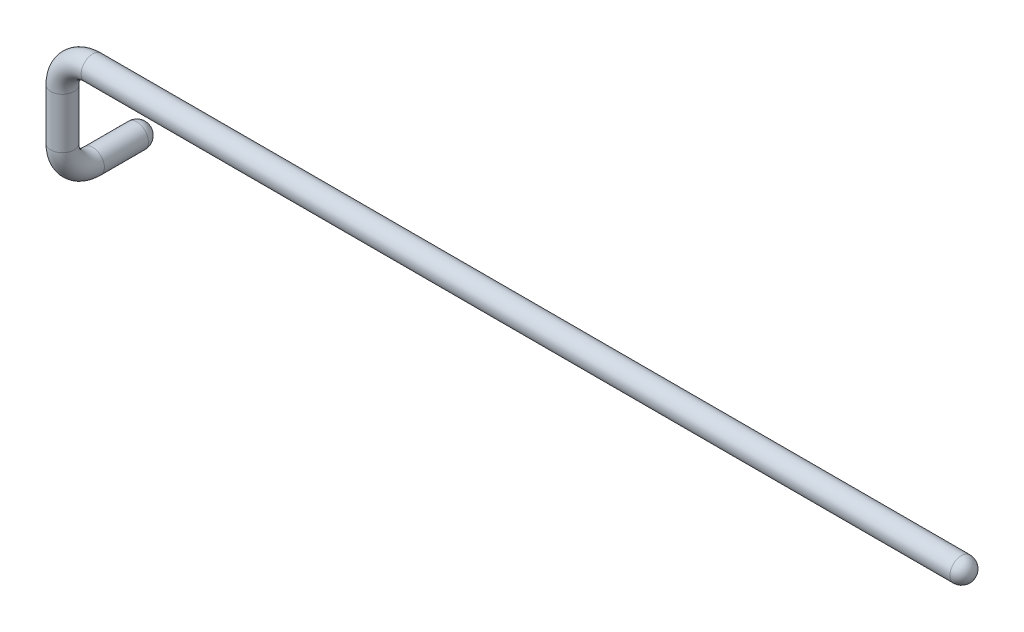
ISO-10303-21;
HEADER;
FILE_DESCRIPTION(('STEP AP214'),'2;1');
FILE_NAME('part.step','',(''),(''),'','','');
FILE_SCHEMA(('AUTOMOTIVE_DESIGN { 1 0 10303 214 1 1 1 1 }'));
ENDSEC;
DATA;
#1=APPLICATION_CONTEXT('core data for automotive mechanical design processes');
#2=APPLICATION_PROTOCOL_DEFINITION('international standard','automotive_design',2000,#1);
#3=PRODUCT_CONTEXT('',#1,'mechanical');
#4=PRODUCT('Part','Part','',(#3));
#5=PRODUCT_RELATED_PRODUCT_CATEGORY('part','',(#4));
#6=PRODUCT_DEFINITION_FORMATION('','',#4);
#7=PRODUCT_DEFINITION_CONTEXT('part definition',#1,'design');
#8=PRODUCT_DEFINITION('design','',#6,#7);
#9=PRODUCT_DEFINITION_SHAPE('','',#8);
#10=(LENGTH_UNIT() NAMED_UNIT(*) SI_UNIT(.MILLI.,.METRE.));
#11=(NAMED_UNIT(*) PLANE_ANGLE_UNIT() SI_UNIT($,.RADIAN.));
#12=(NAMED_UNIT(*) SI_UNIT($,.STERADIAN.) SOLID_ANGLE_UNIT());
#13=UNCERTAINTY_MEASURE_WITH_UNIT(LENGTH_MEASURE(1.E-05),#10,'distance_accuracy_value','');
#14=(GEOMETRIC_REPRESENTATION_CONTEXT(3) GLOBAL_UNCERTAINTY_ASSIGNED_CONTEXT((#13)) GLOBAL_UNIT_ASSIGNED_CONTEXT((#10,
#11,#12)) REPRESENTATION_CONTEXT('',''));
#15=CARTESIAN_POINT('',(0.,0.,0.));
#16=DIRECTION('',(0.,0.,1.));
#17=DIRECTION('',(1.,0.,0.));
#18=AXIS2_PLACEMENT_3D('',#15,#16,#17);
#19=CARTESIAN_POINT('',(0.,0.,0.));
#20=DIRECTION('',(0.,1.,0.));
#21=DIRECTION('',(0.,0.,1.));
#22=AXIS2_PLACEMENT_3D('',#19,#20,#21);
#23=CYLINDRICAL_SURFACE('',#22,0.575);
#24=CARTESIAN_POINT('',(0.,2.25,0.));
#25=DIRECTION('',(0.,1.,0.));
#26=DIRECTION('',(0.,0.,-1.));
#27=AXIS2_PLACEMENT_3D('',#24,#25,#26);
#28=CIRCLE('',#27,0.575);
#29=CARTESIAN_POINT('',(-0.575,2.25,0.));
#30=VERTEX_POINT('',#29);
#31=EDGE_CURVE('E51',#30,#30,#28,.T.);
#32=ORIENTED_EDGE('',*,*,#31,.F.);
#33=EDGE_LOOP('',(#32));
#34=FACE_BOUND('',#33,.T.);
#35=CARTESIAN_POINT('',(0.,-0.249999999999989,0.));
#36=DIRECTION('',(0.,1.,0.));
#37=DIRECTION('',(0.,0.,1.));
#38=AXIS2_PLACEMENT_3D('',#35,#36,#37);
#39=CIRCLE('',#38,0.575);
#40=CARTESIAN_POINT('',(0.,-0.249999999999985,0.575));
#41=VERTEX_POINT('',#40);
#42=EDGE_CURVE('E59',#41,#41,#39,.T.);
#43=ORIENTED_EDGE('',*,*,#42,.T.);
#44=EDGE_LOOP('',(#43));
#45=FACE_BOUND('',#44,.T.);
#46=ADVANCED_FACE('F36',(#34,#45),#23,.T.);
#47=CARTESIAN_POINT('',(1.5,2.25,0.));
#48=DIRECTION('',(0.,0.,-1.));
#49=DIRECTION('',(-1.,0.,0.));
#50=AXIS2_PLACEMENT_3D('',#47,#48,#49);
#51=TOROIDAL_SURFACE('',#50,1.5,0.575);
#52=CARTESIAN_POINT('',(1.5,3.75,0.));
#53=DIRECTION('',(1.,0.,0.));
#54=DIRECTION('',(0.,0.,-1.));
#55=AXIS2_PLACEMENT_3D('',#52,#53,#54);
#56=CIRCLE('',#55,0.575);
#57=CARTESIAN_POINT('',(1.5,4.325,0.));
#58=VERTEX_POINT('',#57);
#59=EDGE_CURVE('E47',#58,#58,#56,.T.);
#60=CARTESIAN_POINT('',(1.5,2.25,0.));
#61=DIRECTION('',(0.,0.,-1.));
#62=DIRECTION('',(-1.,0.,0.));
#63=AXIS2_PLACEMENT_3D('',#60,#61,#62);
#64=CIRCLE('',#63,2.075);
#65=EDGE_CURVE('',#30,#58,#64,.T.);
#66=ORIENTED_EDGE('',*,*,#31,.T.);
#67=ORIENTED_EDGE('',*,*,#59,.F.);
#68=ORIENTED_EDGE('',*,*,#65,.T.);
#69=ORIENTED_EDGE('',*,*,#65,.F.);
#70=EDGE_LOOP('',(#66,#68,#67,#69));
#71=FACE_BOUND('',#70,.T.);
#72=ADVANCED_FACE('F76',(#71),#51,.T.);
#73=CARTESIAN_POINT('',(1.5,3.75,0.));
#74=DIRECTION('',(1.,0.,0.));
#75=DIRECTION('',(0.,0.,-1.));
#76=AXIS2_PLACEMENT_3D('',#73,#74,#75);
#77=CYLINDRICAL_SURFACE('',#76,0.575);
#78=CARTESIAN_POINT('',(44.425,3.75,0.));
#79=DIRECTION('',(1.,0.,0.));
#80=DIRECTION('',(0.,0.,-1.));
#81=AXIS2_PLACEMENT_3D('',#78,#79,#80);
#82=CIRCLE('',#81,0.575);
#83=CARTESIAN_POINT('',(44.425,3.75,-0.575));
#84=VERTEX_POINT('',#83);
#85=EDGE_CURVE('E11',#84,#84,#82,.F.);
#86=ORIENTED_EDGE('',*,*,#85,.T.);
#87=EDGE_LOOP('',(#86));
#88=FACE_BOUND('',#87,.T.);
#89=ORIENTED_EDGE('',*,*,#59,.T.);
#90=EDGE_LOOP('',(#89));
#91=FACE_BOUND('',#90,.T.);
#92=ADVANCED_FACE('F67',(#88,#91),#77,.T.);
#93=CARTESIAN_POINT('',(0.,-0.25,-1.5));
#94=DIRECTION('',(1.,0.,0.));
#95=DIRECTION('',(0.,0.,-1.));
#96=AXIS2_PLACEMENT_3D('',#93,#94,#95);
#97=TOROIDAL_SURFACE('',#96,1.5,0.575);
#98=CARTESIAN_POINT('',(0.,-1.75,-1.50000000000001));
#99=DIRECTION('',(0.,0.,1.));
#100=DIRECTION('',(0.,-1.,0.));
#101=AXIS2_PLACEMENT_3D('',#98,#99,#100);
#102=CIRCLE('',#101,0.575);
#103=CARTESIAN_POINT('',(0.,-2.325,-1.50000000000001));
#104=VERTEX_POINT('',#103);
#105=EDGE_CURVE('E56',#104,#104,#102,.T.);
#106=CARTESIAN_POINT('',(0.,-0.25,-1.5));
#107=DIRECTION('',(1.,0.,0.));
#108=DIRECTION('',(0.,0.,-1.));
#109=AXIS2_PLACEMENT_3D('',#106,#107,#108);
#110=CIRCLE('',#109,2.075);
#111=EDGE_CURVE('',#41,#104,#110,.T.);
#112=ORIENTED_EDGE('',*,*,#42,.F.);
#113=ORIENTED_EDGE('',*,*,#105,.T.);
#114=ORIENTED_EDGE('',*,*,#111,.T.);
#115=ORIENTED_EDGE('',*,*,#111,.F.);
#116=EDGE_LOOP('',(#112,#114,#113,#115));
#117=FACE_BOUND('',#116,.T.);
#118=ADVANCED_FACE('F64',(#117),#97,.T.);
#119=CARTESIAN_POINT('',(0.,-1.75,-1.50000000000001));
#120=DIRECTION('',(0.,0.,-1.));
#121=DIRECTION('',(-1.,0.,0.));
#122=AXIS2_PLACEMENT_3D('',#119,#120,#121);
#123=CYLINDRICAL_SURFACE('',#122,0.575);
#124=CARTESIAN_POINT('',(0.,-1.75,-3.675));
#125=DIRECTION('',(0.,0.,-1.));
#126=DIRECTION('',(-1.,0.,0.));
#127=AXIS2_PLACEMENT_3D('',#124,#125,#126);
#128=CIRCLE('',#127,0.575);
#129=CARTESIAN_POINT('',(-0.575,-1.75,-3.675));
#130=VERTEX_POINT('',#129);
#131=EDGE_CURVE('E43',#130,#130,#128,.F.);
#132=ORIENTED_EDGE('',*,*,#131,.T.);
#133=EDGE_LOOP('',(#132));
#134=FACE_BOUND('',#133,.T.);
#135=ORIENTED_EDGE('',*,*,#105,.F.);
#136=EDGE_LOOP('',(#135));
#137=FACE_BOUND('',#136,.T.);
#138=ADVANCED_FACE('F66',(#134,#137),#123,.T.);
#139=CARTESIAN_POINT('',(0.,-1.75,-3.675));
#140=DIRECTION('',(0.,0.,1.));
#141=DIRECTION('',(0.,-1.,0.));
#142=AXIS2_PLACEMENT_3D('',#139,#140,#141);
#143=SPHERICAL_SURFACE('',#142,0.575);
#144=ORIENTED_EDGE('',*,*,#131,.F.);
#145=EDGE_LOOP('',(#144));
#146=FACE_BOUND('',#145,.T.);
#147=ADVANCED_FACE('F70',(#146),#143,.T.);
#148=CARTESIAN_POINT('',(44.425,3.75,0.));
#149=DIRECTION('',(1.,0.,0.));
#150=DIRECTION('',(0.,0.,-1.));
#151=AXIS2_PLACEMENT_3D('',#148,#149,#150);
#152=SPHERICAL_SURFACE('',#151,0.575);
#153=ORIENTED_EDGE('',*,*,#85,.F.);
#154=EDGE_LOOP('',(#153));
#155=FACE_BOUND('',#154,.T.);
#156=ADVANCED_FACE('F38',(#155),#152,.T.);
#157=CLOSED_SHELL('',(#46,#72,#92,#118,#138,#147,#156));
#158=MANIFOLD_SOLID_BREP('B2',#157);
#159=ADVANCED_BREP_SHAPE_REPRESENTATION('',(#18,#158),#14);
#160=SHAPE_DEFINITION_REPRESENTATION(#9,#159);
ENDSEC;
END-ISO-10303-21;
